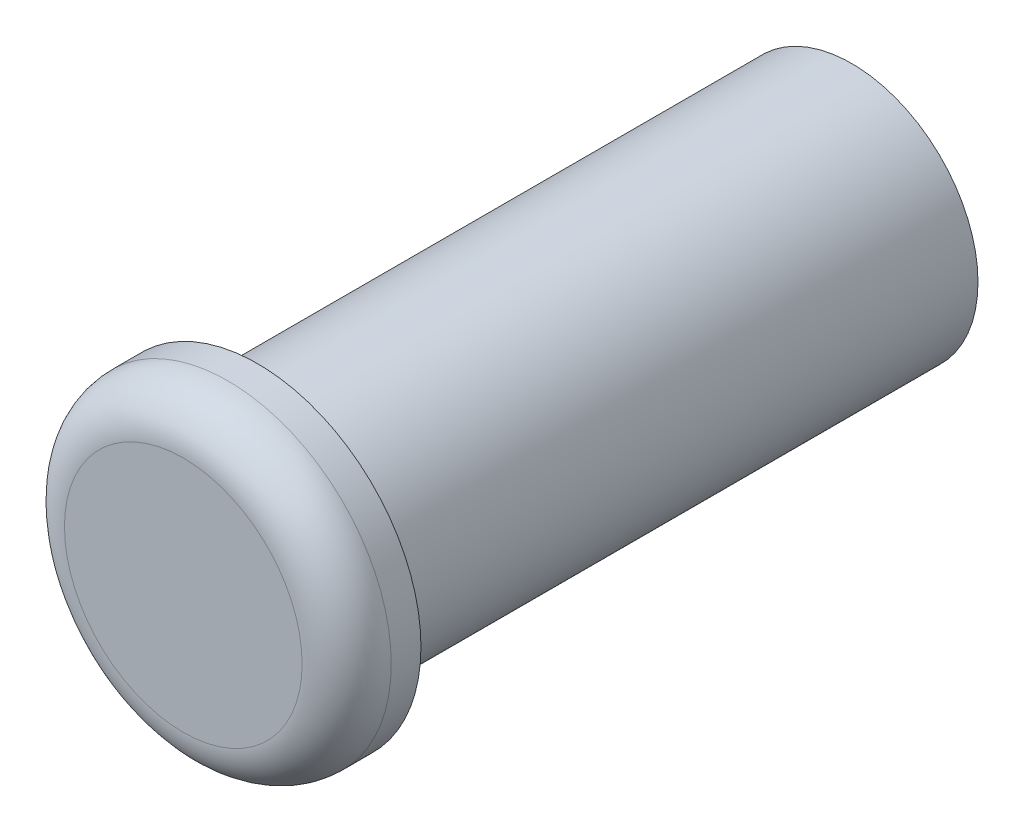
ISO-10303-21;
HEADER;
FILE_DESCRIPTION(('STEP AP214'),'2;1');
FILE_NAME('part.step','',(''),(''),'','','');
FILE_SCHEMA(('AUTOMOTIVE_DESIGN { 1 0 10303 214 1 1 1 1 }'));
ENDSEC;
DATA;
#1=APPLICATION_CONTEXT('core data for automotive mechanical design processes');
#2=APPLICATION_PROTOCOL_DEFINITION('international standard','automotive_design',2000,#1);
#3=PRODUCT_CONTEXT('',#1,'mechanical');
#4=PRODUCT('Part','Part','',(#3));
#5=PRODUCT_RELATED_PRODUCT_CATEGORY('part','',(#4));
#6=PRODUCT_DEFINITION_FORMATION('','',#4);
#7=PRODUCT_DEFINITION_CONTEXT('part definition',#1,'design');
#8=PRODUCT_DEFINITION('design','',#6,#7);
#9=PRODUCT_DEFINITION_SHAPE('','',#8);
#10=(LENGTH_UNIT() NAMED_UNIT(*) SI_UNIT(.MILLI.,.METRE.));
#11=(NAMED_UNIT(*) PLANE_ANGLE_UNIT() SI_UNIT($,.RADIAN.));
#12=(NAMED_UNIT(*) SI_UNIT($,.STERADIAN.) SOLID_ANGLE_UNIT());
#13=UNCERTAINTY_MEASURE_WITH_UNIT(LENGTH_MEASURE(1.E-05),#10,'distance_accuracy_value','');
#14=(GEOMETRIC_REPRESENTATION_CONTEXT(3) GLOBAL_UNCERTAINTY_ASSIGNED_CONTEXT((#13)) GLOBAL_UNIT_ASSIGNED_CONTEXT((#10,
#11,#12)) REPRESENTATION_CONTEXT('',''));
#15=CARTESIAN_POINT('',(0.,0.,0.));
#16=DIRECTION('',(0.,0.,1.));
#17=DIRECTION('',(1.,0.,0.));
#18=AXIS2_PLACEMENT_3D('',#15,#16,#17);
#19=CARTESIAN_POINT('',(0.,0.,40.));
#20=DIRECTION('',(0.,0.,-1.));
#21=DIRECTION('',(-1.,0.,0.));
#22=AXIS2_PLACEMENT_3D('',#19,#20,#21);
#23=CYLINDRICAL_SURFACE('',#22,8.5);
#24=CARTESIAN_POINT('',(0.,0.,40.));
#25=DIRECTION('',(0.,0.,1.));
#26=DIRECTION('',(1.,0.,0.));
#27=AXIS2_PLACEMENT_3D('',#24,#25,#26);
#28=CIRCLE('',#27,8.5);
#29=CARTESIAN_POINT('',(8.5,0.,40.));
#30=VERTEX_POINT('',#29);
#31=EDGE_CURVE('E50',#30,#30,#28,.T.);
#32=ORIENTED_EDGE('',*,*,#31,.F.);
#33=EDGE_LOOP('',(#32));
#34=FACE_BOUND('',#33,.T.);
#35=CARTESIAN_POINT('',(0.,0.,0.));
#36=DIRECTION('',(0.,0.,1.));
#37=DIRECTION('',(1.,0.,0.));
#38=AXIS2_PLACEMENT_3D('',#35,#36,#37);
#39=CIRCLE('',#38,8.5);
#40=CARTESIAN_POINT('',(8.5,0.,0.));
#41=VERTEX_POINT('',#40);
#42=EDGE_CURVE('E55',#41,#41,#39,.T.);
#43=ORIENTED_EDGE('',*,*,#42,.T.);
#44=EDGE_LOOP('',(#43));
#45=FACE_BOUND('',#44,.T.);
#46=ADVANCED_FACE('F37',(#34,#45),#23,.T.);
#47=CARTESIAN_POINT('',(0.,0.,0.));
#48=DIRECTION('',(0.,0.,1.));
#49=DIRECTION('',(1.,0.,0.));
#50=AXIS2_PLACEMENT_3D('',#47,#48,#49);
#51=PLANE('',#50);
#52=ORIENTED_EDGE('',*,*,#42,.F.);
#53=EDGE_LOOP('',(#52));
#54=FACE_BOUND('',#53,.T.);
#55=ADVANCED_FACE('F81',(#54),#51,.F.);
#56=CARTESIAN_POINT('',(0.,0.,45.));
#57=DIRECTION('',(0.,0.,-1.));
#58=DIRECTION('',(-1.,0.,0.));
#59=AXIS2_PLACEMENT_3D('',#56,#57,#58);
#60=CYLINDRICAL_SURFACE('',#59,11.);
#61=CARTESIAN_POINT('',(0.,0.,42.));
#62=DIRECTION('',(0.,0.,1.));
#63=DIRECTION('',(1.,0.,0.));
#64=AXIS2_PLACEMENT_3D('',#61,#62,#63);
#65=CIRCLE('',#64,11.);
#66=CARTESIAN_POINT('',(11.,0.,42.));
#67=VERTEX_POINT('',#66);
#68=EDGE_CURVE('E10',#67,#67,#65,.F.);
#69=ORIENTED_EDGE('',*,*,#68,.T.);
#70=EDGE_LOOP('',(#69));
#71=FACE_BOUND('',#70,.T.);
#72=CARTESIAN_POINT('',(0.,0.,40.));
#73=DIRECTION('',(0.,0.,1.));
#74=DIRECTION('',(1.,0.,0.));
#75=AXIS2_PLACEMENT_3D('',#72,#73,#74);
#76=CIRCLE('',#75,11.);
#77=CARTESIAN_POINT('',(11.,0.,40.));
#78=VERTEX_POINT('',#77);
#79=EDGE_CURVE('E60',#78,#78,#76,.T.);
#80=ORIENTED_EDGE('',*,*,#79,.T.);
#81=EDGE_LOOP('',(#80));
#82=FACE_BOUND('',#81,.T.);
#83=ADVANCED_FACE('F66',(#71,#82),#60,.T.);
#84=CARTESIAN_POINT('',(0.,0.,45.));
#85=DIRECTION('',(0.,0.,1.));
#86=DIRECTION('',(1.,0.,0.));
#87=AXIS2_PLACEMENT_3D('',#84,#85,#86);
#88=PLANE('',#87);
#89=CARTESIAN_POINT('',(0.,0.,45.));
#90=DIRECTION('',(0.,0.,1.));
#91=DIRECTION('',(1.,0.,0.));
#92=AXIS2_PLACEMENT_3D('',#89,#90,#91);
#93=CIRCLE('',#92,8.);
#94=CARTESIAN_POINT('',(8.,0.,45.));
#95=VERTEX_POINT('',#94);
#96=EDGE_CURVE('E45',#95,#95,#93,.T.);
#97=ORIENTED_EDGE('',*,*,#96,.T.);
#98=EDGE_LOOP('',(#97));
#99=FACE_BOUND('',#98,.T.);
#100=ADVANCED_FACE('F70',(#99),#88,.T.);
#101=CARTESIAN_POINT('',(0.,0.,40.));
#102=DIRECTION('',(0.,0.,1.));
#103=DIRECTION('',(1.,0.,0.));
#104=AXIS2_PLACEMENT_3D('',#101,#102,#103);
#105=PLANE('',#104);
#106=ORIENTED_EDGE('',*,*,#31,.T.);
#107=EDGE_LOOP('',(#106));
#108=FACE_BOUND('',#107,.T.);
#109=ORIENTED_EDGE('',*,*,#79,.F.);
#110=EDGE_LOOP('',(#109));
#111=FACE_BOUND('',#110,.T.);
#112=ADVANCED_FACE('F68',(#108,#111),#105,.F.);
#113=CARTESIAN_POINT('',(0.,0.,42.));
#114=DIRECTION('',(0.,0.,1.));
#115=DIRECTION('',(1.,0.,0.));
#116=AXIS2_PLACEMENT_3D('',#113,#114,#115);
#117=TOROIDAL_SURFACE('',#116,8.,3.);
#118=ORIENTED_EDGE('',*,*,#68,.F.);
#119=EDGE_LOOP('',(#118));
#120=FACE_BOUND('',#119,.T.);
#121=ORIENTED_EDGE('',*,*,#96,.F.);
#122=EDGE_LOOP('',(#121));
#123=FACE_BOUND('',#122,.T.);
#124=ADVANCED_FACE('F39',(#120,#123),#117,.T.);
#125=CLOSED_SHELL('',(#46,#55,#83,#100,#112,#124));
#126=MANIFOLD_SOLID_BREP('B2',#125);
#127=ADVANCED_BREP_SHAPE_REPRESENTATION('',(#18,#126),#14);
#128=SHAPE_DEFINITION_REPRESENTATION(#9,#127);
ENDSEC;
END-ISO-10303-21;
